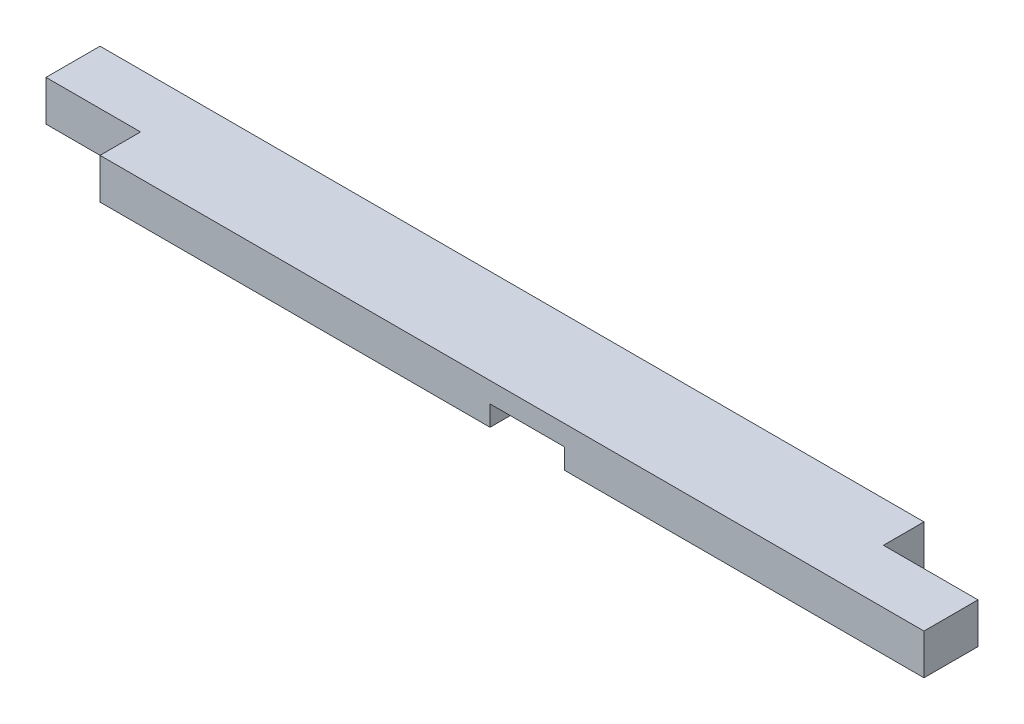
ISO-10303-21;
HEADER;
FILE_DESCRIPTION(('STEP AP214'),'2;1');
FILE_NAME('part.step','',(''),(''),'','','');
FILE_SCHEMA(('AUTOMOTIVE_DESIGN { 1 0 10303 214 1 1 1 1 }'));
ENDSEC;
DATA;
#1=APPLICATION_CONTEXT('core data for automotive mechanical design processes');
#2=APPLICATION_PROTOCOL_DEFINITION('international standard','automotive_design',2000,#1);
#3=PRODUCT_CONTEXT('',#1,'mechanical');
#4=PRODUCT('Part','Part','',(#3));
#5=PRODUCT_RELATED_PRODUCT_CATEGORY('part','',(#4));
#6=PRODUCT_DEFINITION_FORMATION('','',#4);
#7=PRODUCT_DEFINITION_CONTEXT('part definition',#1,'design');
#8=PRODUCT_DEFINITION('design','',#6,#7);
#9=PRODUCT_DEFINITION_SHAPE('','',#8);
#10=(LENGTH_UNIT() NAMED_UNIT(*) SI_UNIT(.MILLI.,.METRE.));
#11=(NAMED_UNIT(*) PLANE_ANGLE_UNIT() SI_UNIT($,.RADIAN.));
#12=(NAMED_UNIT(*) SI_UNIT($,.STERADIAN.) SOLID_ANGLE_UNIT());
#13=UNCERTAINTY_MEASURE_WITH_UNIT(LENGTH_MEASURE(1.E-05),#10,'distance_accuracy_value','');
#14=(GEOMETRIC_REPRESENTATION_CONTEXT(3) GLOBAL_UNCERTAINTY_ASSIGNED_CONTEXT((#13)) GLOBAL_UNIT_ASSIGNED_CONTEXT((#10,
#11,#12)) REPRESENTATION_CONTEXT('',''));
#15=CARTESIAN_POINT('',(0.,0.,0.));
#16=DIRECTION('',(0.,0.,1.));
#17=DIRECTION('',(1.,0.,0.));
#18=AXIS2_PLACEMENT_3D('',#15,#16,#17);
#19=CARTESIAN_POINT('',(0.,0.,0.));
#20=DIRECTION('',(0.,-1.,0.));
#21=DIRECTION('',(0.,0.,-1.));
#22=AXIS2_PLACEMENT_3D('',#19,#20,#21);
#23=PLANE('',#22);
#24=DIRECTION('',(0.,0.,-1.));
#25=VECTOR('',#24,1.);
#26=CARTESIAN_POINT('',(525.4625,0.,0.));
#27=LINE('',#26,#25);
#28=CARTESIAN_POINT('',(525.4625,0.,0.));
#29=VERTEX_POINT('',#28);
#30=CARTESIAN_POINT('',(525.4625,0.,-88.9));
#31=VERTEX_POINT('',#30);
#32=EDGE_CURVE('E197',#29,#31,#27,.T.);
#33=ORIENTED_EDGE('',*,*,#32,.T.);
#34=DIRECTION('',(-1.,0.,0.));
#35=VECTOR('',#34,1.);
#36=CARTESIAN_POINT('',(0.,0.,-88.9));
#37=LINE('',#36,#35);
#38=CARTESIAN_POINT('',(774.7,0.,-88.9));
#39=VERTEX_POINT('',#38);
#40=EDGE_CURVE('E153',#39,#31,#37,.T.);
#41=ORIENTED_EDGE('',*,*,#40,.F.);
#42=DIRECTION('',(0.,0.,1.));
#43=VECTOR('',#42,1.);
#44=CARTESIAN_POINT('',(774.7,0.,-88.9));
#45=LINE('',#44,#43);
#46=CARTESIAN_POINT('',(774.7,0.,-50.8));
#47=VERTEX_POINT('',#46);
#48=EDGE_CURVE('E213',#39,#47,#45,.T.);
#49=ORIENTED_EDGE('',*,*,#48,.T.);
#50=DIRECTION('',(1.,0.,0.));
#51=VECTOR('',#50,1.);
#52=CARTESIAN_POINT('',(863.6,0.,-50.8));
#53=LINE('',#52,#51);
#54=CARTESIAN_POINT('',(863.6,0.,-50.8));
#55=VERTEX_POINT('',#54);
#56=EDGE_CURVE('E216',#47,#55,#53,.T.);
#57=ORIENTED_EDGE('',*,*,#56,.T.);
#58=DIRECTION('',(0.,0.,-1.));
#59=VECTOR('',#58,1.);
#60=CARTESIAN_POINT('',(863.6,0.,0.));
#61=LINE('',#60,#59);
#62=CARTESIAN_POINT('',(863.6,0.,0.));
#63=VERTEX_POINT('',#62);
#64=EDGE_CURVE('E171',#63,#55,#61,.T.);
#65=ORIENTED_EDGE('',*,*,#64,.F.);
#66=DIRECTION('',(1.,0.,0.));
#67=VECTOR('',#66,1.);
#68=CARTESIAN_POINT('',(0.,0.,0.));
#69=LINE('',#68,#67);
#70=EDGE_CURVE('E168',#29,#63,#69,.T.);
#71=ORIENTED_EDGE('',*,*,#70,.F.);
#72=EDGE_LOOP('',(#33,#41,#49,#57,#65,#71));
#73=FACE_BOUND('',#72,.T.);
#74=ADVANCED_FACE('F39',(#73),#23,.T.);
#75=CARTESIAN_POINT('',(0.,38.1,0.));
#76=DIRECTION('',(1.,0.,0.));
#77=DIRECTION('',(0.,0.,-1.));
#78=AXIS2_PLACEMENT_3D('',#75,#76,#77);
#79=PLANE('',#78);
#80=DIRECTION('',(0.,0.,1.));
#81=VECTOR('',#80,1.);
#82=CARTESIAN_POINT('',(0.,0.,0.));
#83=LINE('',#82,#81);
#84=CARTESIAN_POINT('',(0.,0.,-88.9));
#85=VERTEX_POINT('',#84);
#86=CARTESIAN_POINT('',(0.,0.,-38.1));
#87=VERTEX_POINT('',#86);
#88=EDGE_CURVE('E145',#85,#87,#83,.T.);
#89=ORIENTED_EDGE('',*,*,#88,.T.);
#90=DIRECTION('',(0.,-1.,0.));
#91=VECTOR('',#90,1.);
#92=CARTESIAN_POINT('',(0.,38.1,-38.1));
#93=LINE('',#92,#91);
#94=CARTESIAN_POINT('',(0.,38.1,-38.1));
#95=VERTEX_POINT('',#94);
#96=EDGE_CURVE('E54',#95,#87,#93,.T.);
#97=ORIENTED_EDGE('',*,*,#96,.F.);
#98=DIRECTION('',(0.,0.,1.));
#99=VECTOR('',#98,1.);
#100=CARTESIAN_POINT('',(0.,38.1,0.));
#101=LINE('',#100,#99);
#102=CARTESIAN_POINT('',(0.,38.1,-88.9));
#103=VERTEX_POINT('',#102);
#104=EDGE_CURVE('E143',#103,#95,#101,.T.);
#105=ORIENTED_EDGE('',*,*,#104,.F.);
#106=DIRECTION('',(0.,-1.,0.));
#107=VECTOR('',#106,1.);
#108=CARTESIAN_POINT('',(0.,38.1,-88.9));
#109=LINE('',#108,#107);
#110=EDGE_CURVE('E47',#103,#85,#109,.T.);
#111=ORIENTED_EDGE('',*,*,#110,.T.);
#112=EDGE_LOOP('',(#89,#97,#105,#111));
#113=FACE_BOUND('',#112,.T.);
#114=ADVANCED_FACE('F41',(#113),#79,.F.);
#115=CARTESIAN_POINT('',(0.,38.1,0.));
#116=DIRECTION('',(0.,0.,-1.));
#117=DIRECTION('',(-1.,0.,0.));
#118=AXIS2_PLACEMENT_3D('',#115,#116,#117);
#119=PLANE('',#118);
#120=DIRECTION('',(1.,0.,0.));
#121=VECTOR('',#120,1.);
#122=CARTESIAN_POINT('',(0.,38.1,0.));
#123=LINE('',#122,#121);
#124=CARTESIAN_POINT('',(88.9,38.1,0.));
#125=VERTEX_POINT('',#124);
#126=CARTESIAN_POINT('',(863.6,38.1,0.));
#127=VERTEX_POINT('',#126);
#128=EDGE_CURVE('E152',#125,#127,#123,.T.);
#129=ORIENTED_EDGE('',*,*,#128,.F.);
#130=DIRECTION('',(0.,-1.,0.));
#131=VECTOR('',#130,1.);
#132=CARTESIAN_POINT('',(88.9,38.1,0.));
#133=LINE('',#132,#131);
#134=CARTESIAN_POINT('',(88.9,0.,0.));
#135=VERTEX_POINT('',#134);
#136=EDGE_CURVE('E184',#125,#135,#133,.T.);
#137=ORIENTED_EDGE('',*,*,#136,.T.);
#138=CARTESIAN_POINT('',(455.6125,0.,0.));
#139=VERTEX_POINT('',#138);
#140=EDGE_CURVE('E62',#135,#139,#69,.T.);
#141=ORIENTED_EDGE('',*,*,#140,.T.);
#142=DIRECTION('',(0.,1.,0.));
#143=VECTOR('',#142,1.);
#144=CARTESIAN_POINT('',(455.6125,19.0499999999991,0.));
#145=LINE('',#144,#143);
#146=CARTESIAN_POINT('',(455.6125,19.0499999999991,0.));
#147=VERTEX_POINT('',#146);
#148=EDGE_CURVE('E191',#139,#147,#145,.T.);
#149=ORIENTED_EDGE('',*,*,#148,.T.);
#150=DIRECTION('',(1.,0.,0.));
#151=VECTOR('',#150,1.);
#152=CARTESIAN_POINT('',(525.4625,19.0499999999991,0.));
#153=LINE('',#152,#151);
#154=CARTESIAN_POINT('',(525.4625,19.0499999999991,0.));
#155=VERTEX_POINT('',#154);
#156=EDGE_CURVE('E194',#147,#155,#153,.T.);
#157=ORIENTED_EDGE('',*,*,#156,.T.);
#158=DIRECTION('',(0.,-1.,0.));
#159=VECTOR('',#158,1.);
#160=CARTESIAN_POINT('',(525.4625,19.0499999999991,0.));
#161=LINE('',#160,#159);
#162=EDGE_CURVE('E188',#155,#29,#161,.T.);
#163=ORIENTED_EDGE('',*,*,#162,.T.);
#164=ORIENTED_EDGE('',*,*,#70,.T.);
#165=DIRECTION('',(0.,-1.,0.));
#166=VECTOR('',#165,1.);
#167=CARTESIAN_POINT('',(863.6,38.1,0.));
#168=LINE('',#167,#166);
#169=EDGE_CURVE('E11',#127,#63,#168,.T.);
#170=ORIENTED_EDGE('',*,*,#169,.F.);
#171=EDGE_LOOP('',(#129,#137,#141,#149,#157,#163,#164,#170));
#172=FACE_BOUND('',#171,.T.);
#173=ADVANCED_FACE('F244',(#172),#119,.F.);
#174=CARTESIAN_POINT('',(863.6,38.1,0.));
#175=DIRECTION('',(-1.,0.,0.));
#176=DIRECTION('',(0.,0.,1.));
#177=AXIS2_PLACEMENT_3D('',#174,#175,#176);
#178=PLANE('',#177);
#179=ORIENTED_EDGE('',*,*,#64,.T.);
#180=DIRECTION('',(0.,1.,0.));
#181=VECTOR('',#180,1.);
#182=CARTESIAN_POINT('',(863.6,0.,-50.8));
#183=LINE('',#182,#181);
#184=CARTESIAN_POINT('',(863.6,38.1,-50.8));
#185=VERTEX_POINT('',#184);
#186=EDGE_CURVE('E169',#55,#185,#183,.T.);
#187=ORIENTED_EDGE('',*,*,#186,.T.);
#188=DIRECTION('',(0.,0.,-1.));
#189=VECTOR('',#188,1.);
#190=CARTESIAN_POINT('',(863.6,38.1,0.));
#191=LINE('',#190,#189);
#192=EDGE_CURVE('E155',#127,#185,#191,.T.);
#193=ORIENTED_EDGE('',*,*,#192,.F.);
#194=ORIENTED_EDGE('',*,*,#169,.T.);
#195=EDGE_LOOP('',(#179,#187,#193,#194));
#196=FACE_BOUND('',#195,.T.);
#197=ADVANCED_FACE('F235',(#196),#178,.F.);
#198=CARTESIAN_POINT('',(0.,38.1,-88.9));
#199=DIRECTION('',(0.,0.,1.));
#200=DIRECTION('',(1.,0.,0.));
#201=AXIS2_PLACEMENT_3D('',#198,#199,#200);
#202=PLANE('',#201);
#203=ORIENTED_EDGE('',*,*,#40,.T.);
#204=DIRECTION('',(0.,-1.,0.));
#205=VECTOR('',#204,1.);
#206=CARTESIAN_POINT('',(525.4625,19.0499999999991,-88.9));
#207=LINE('',#206,#205);
#208=CARTESIAN_POINT('',(525.4625,19.0499999999991,-88.9));
#209=VERTEX_POINT('',#208);
#210=EDGE_CURVE('E186',#209,#31,#207,.T.);
#211=ORIENTED_EDGE('',*,*,#210,.F.);
#212=DIRECTION('',(1.,0.,0.));
#213=VECTOR('',#212,1.);
#214=CARTESIAN_POINT('',(525.4625,19.0499999999991,-88.9));
#215=LINE('',#214,#213);
#216=CARTESIAN_POINT('',(455.6125,19.0499999999991,-88.9));
#217=VERTEX_POINT('',#216);
#218=EDGE_CURVE('E192',#217,#209,#215,.T.);
#219=ORIENTED_EDGE('',*,*,#218,.F.);
#220=DIRECTION('',(0.,1.,0.));
#221=VECTOR('',#220,1.);
#222=CARTESIAN_POINT('',(455.6125,19.0499999999991,-88.9));
#223=LINE('',#222,#221);
#224=CARTESIAN_POINT('',(455.6125,0.,-88.9));
#225=VERTEX_POINT('',#224);
#226=EDGE_CURVE('E199',#225,#217,#223,.T.);
#227=ORIENTED_EDGE('',*,*,#226,.F.);
#228=EDGE_CURVE('E158',#225,#85,#37,.T.);
#229=ORIENTED_EDGE('',*,*,#228,.T.);
#230=ORIENTED_EDGE('',*,*,#110,.F.);
#231=DIRECTION('',(-1.,0.,0.));
#232=VECTOR('',#231,1.);
#233=CARTESIAN_POINT('',(0.,38.1,-88.9));
#234=LINE('',#233,#232);
#235=CARTESIAN_POINT('',(774.7,38.1,-88.9));
#236=VERTEX_POINT('',#235);
#237=EDGE_CURVE('E150',#236,#103,#234,.T.);
#238=ORIENTED_EDGE('',*,*,#237,.F.);
#239=DIRECTION('',(0.,1.,0.));
#240=VECTOR('',#239,1.);
#241=CARTESIAN_POINT('',(774.7,0.,-88.9));
#242=LINE('',#241,#240);
#243=EDGE_CURVE('E161',#39,#236,#242,.T.);
#244=ORIENTED_EDGE('',*,*,#243,.F.);
#245=EDGE_LOOP('',(#203,#211,#219,#227,#229,#230,#238,#244));
#246=FACE_BOUND('',#245,.T.);
#247=ADVANCED_FACE('F232',(#246),#202,.F.);
#248=CARTESIAN_POINT('',(0.,38.1,0.));
#249=DIRECTION('',(0.,-1.,0.));
#250=DIRECTION('',(0.,0.,-1.));
#251=AXIS2_PLACEMENT_3D('',#248,#249,#250);
#252=PLANE('',#251);
#253=DIRECTION('',(1.,0.,0.));
#254=VECTOR('',#253,1.);
#255=CARTESIAN_POINT('',(0.,38.1,-38.1));
#256=LINE('',#255,#254);
#257=CARTESIAN_POINT('',(88.9,38.1,-38.1));
#258=VERTEX_POINT('',#257);
#259=EDGE_CURVE('E129',#95,#258,#256,.T.);
#260=ORIENTED_EDGE('',*,*,#259,.T.);
#261=DIRECTION('',(0.,0.,1.));
#262=VECTOR('',#261,1.);
#263=CARTESIAN_POINT('',(88.9,38.1,0.));
#264=LINE('',#263,#262);
#265=EDGE_CURVE('E136',#258,#125,#264,.T.);
#266=ORIENTED_EDGE('',*,*,#265,.T.);
#267=ORIENTED_EDGE('',*,*,#128,.T.);
#268=ORIENTED_EDGE('',*,*,#192,.T.);
#269=DIRECTION('',(1.,0.,0.));
#270=VECTOR('',#269,1.);
#271=CARTESIAN_POINT('',(863.6,38.1,-50.8));
#272=LINE('',#271,#270);
#273=CARTESIAN_POINT('',(774.7,38.1,-50.8));
#274=VERTEX_POINT('',#273);
#275=EDGE_CURVE('E217',#274,#185,#272,.T.);
#276=ORIENTED_EDGE('',*,*,#275,.F.);
#277=DIRECTION('',(0.,0.,1.));
#278=VECTOR('',#277,1.);
#279=CARTESIAN_POINT('',(774.7,38.1,-88.9));
#280=LINE('',#279,#278);
#281=EDGE_CURVE('E206',#236,#274,#280,.T.);
#282=ORIENTED_EDGE('',*,*,#281,.F.);
#283=ORIENTED_EDGE('',*,*,#237,.T.);
#284=ORIENTED_EDGE('',*,*,#104,.T.);
#285=EDGE_LOOP('',(#260,#266,#267,#268,#276,#282,#283,#284));
#286=FACE_BOUND('',#285,.T.);
#287=ADVANCED_FACE('F147',(#286),#252,.F.);
#288=DIRECTION('',(0.,0.,1.));
#289=VECTOR('',#288,1.);
#290=CARTESIAN_POINT('',(88.9,0.,0.));
#291=LINE('',#290,#289);
#292=CARTESIAN_POINT('',(88.9,0.,-38.1));
#293=VERTEX_POINT('',#292);
#294=EDGE_CURVE('E137',#293,#135,#291,.T.);
#295=ORIENTED_EDGE('',*,*,#294,.F.);
#296=DIRECTION('',(1.,0.,0.));
#297=VECTOR('',#296,1.);
#298=CARTESIAN_POINT('',(0.,0.,-38.1));
#299=LINE('',#298,#297);
#300=EDGE_CURVE('E179',#87,#293,#299,.T.);
#301=ORIENTED_EDGE('',*,*,#300,.F.);
#302=ORIENTED_EDGE('',*,*,#88,.F.);
#303=ORIENTED_EDGE('',*,*,#228,.F.);
#304=DIRECTION('',(0.,0.,-1.));
#305=VECTOR('',#304,1.);
#306=CARTESIAN_POINT('',(455.6125,0.,0.));
#307=LINE('',#306,#305);
#308=EDGE_CURVE('E209',#139,#225,#307,.T.);
#309=ORIENTED_EDGE('',*,*,#308,.F.);
#310=ORIENTED_EDGE('',*,*,#140,.F.);
#311=EDGE_LOOP('',(#295,#301,#302,#303,#309,#310));
#312=FACE_BOUND('',#311,.T.);
#313=ADVANCED_FACE('F177',(#312),#23,.T.);
#314=CARTESIAN_POINT('',(863.6,0.,-50.8));
#315=DIRECTION('',(0.,0.,1.));
#316=DIRECTION('',(1.,0.,0.));
#317=AXIS2_PLACEMENT_3D('',#314,#315,#316);
#318=PLANE('',#317);
#319=ORIENTED_EDGE('',*,*,#275,.T.);
#320=ORIENTED_EDGE('',*,*,#186,.F.);
#321=ORIENTED_EDGE('',*,*,#56,.F.);
#322=DIRECTION('',(0.,1.,0.));
#323=VECTOR('',#322,1.);
#324=CARTESIAN_POINT('',(774.7,0.,-50.8));
#325=LINE('',#324,#323);
#326=EDGE_CURVE('E224',#47,#274,#325,.T.);
#327=ORIENTED_EDGE('',*,*,#326,.T.);
#328=EDGE_LOOP('',(#319,#320,#321,#327));
#329=FACE_BOUND('',#328,.T.);
#330=ADVANCED_FACE('F254',(#329),#318,.F.);
#331=CARTESIAN_POINT('',(774.7,0.,-88.9));
#332=DIRECTION('',(-1.,0.,0.));
#333=DIRECTION('',(0.,0.,1.));
#334=AXIS2_PLACEMENT_3D('',#331,#332,#333);
#335=PLANE('',#334);
#336=ORIENTED_EDGE('',*,*,#281,.T.);
#337=ORIENTED_EDGE('',*,*,#326,.F.);
#338=ORIENTED_EDGE('',*,*,#48,.F.);
#339=ORIENTED_EDGE('',*,*,#243,.T.);
#340=EDGE_LOOP('',(#336,#337,#338,#339));
#341=FACE_BOUND('',#340,.T.);
#342=ADVANCED_FACE('F229',(#341),#335,.F.);
#343=CARTESIAN_POINT('',(525.4625,19.0499999999991,0.));
#344=DIRECTION('',(1.,0.,0.));
#345=DIRECTION('',(0.,0.,-1.));
#346=AXIS2_PLACEMENT_3D('',#343,#344,#345);
#347=PLANE('',#346);
#348=ORIENTED_EDGE('',*,*,#210,.T.);
#349=ORIENTED_EDGE('',*,*,#32,.F.);
#350=ORIENTED_EDGE('',*,*,#162,.F.);
#351=DIRECTION('',(0.,0.,-1.));
#352=VECTOR('',#351,1.);
#353=CARTESIAN_POINT('',(525.4625,19.0499999999991,0.));
#354=LINE('',#353,#352);
#355=EDGE_CURVE('E204',#155,#209,#354,.T.);
#356=ORIENTED_EDGE('',*,*,#355,.T.);
#357=EDGE_LOOP('',(#348,#349,#350,#356));
#358=FACE_BOUND('',#357,.T.);
#359=ADVANCED_FACE('F262',(#358),#347,.F.);
#360=CARTESIAN_POINT('',(525.4625,19.0499999999991,0.));
#361=DIRECTION('',(0.,1.,0.));
#362=DIRECTION('',(-1.,0.,0.));
#363=AXIS2_PLACEMENT_3D('',#360,#361,#362);
#364=PLANE('',#363);
#365=ORIENTED_EDGE('',*,*,#218,.T.);
#366=ORIENTED_EDGE('',*,*,#355,.F.);
#367=ORIENTED_EDGE('',*,*,#156,.F.);
#368=DIRECTION('',(0.,0.,-1.));
#369=VECTOR('',#368,1.);
#370=CARTESIAN_POINT('',(455.6125,19.0499999999991,0.));
#371=LINE('',#370,#369);
#372=EDGE_CURVE('E207',#147,#217,#371,.T.);
#373=ORIENTED_EDGE('',*,*,#372,.T.);
#374=EDGE_LOOP('',(#365,#366,#367,#373));
#375=FACE_BOUND('',#374,.T.);
#376=ADVANCED_FACE('F266',(#375),#364,.F.);
#377=CARTESIAN_POINT('',(455.6125,19.0499999999991,0.));
#378=DIRECTION('',(-1.,0.,0.));
#379=DIRECTION('',(0.,0.,1.));
#380=AXIS2_PLACEMENT_3D('',#377,#378,#379);
#381=PLANE('',#380);
#382=ORIENTED_EDGE('',*,*,#226,.T.);
#383=ORIENTED_EDGE('',*,*,#372,.F.);
#384=ORIENTED_EDGE('',*,*,#148,.F.);
#385=ORIENTED_EDGE('',*,*,#308,.T.);
#386=EDGE_LOOP('',(#382,#383,#384,#385));
#387=FACE_BOUND('',#386,.T.);
#388=ADVANCED_FACE('F268',(#387),#381,.F.);
#389=CARTESIAN_POINT('',(88.9,38.1,0.));
#390=DIRECTION('',(1.,0.,0.));
#391=DIRECTION('',(0.,0.,-1.));
#392=AXIS2_PLACEMENT_3D('',#389,#390,#391);
#393=PLANE('',#392);
#394=ORIENTED_EDGE('',*,*,#294,.T.);
#395=ORIENTED_EDGE('',*,*,#136,.F.);
#396=ORIENTED_EDGE('',*,*,#265,.F.);
#397=DIRECTION('',(0.,-1.,0.));
#398=VECTOR('',#397,1.);
#399=CARTESIAN_POINT('',(88.9,38.1,-38.1));
#400=LINE('',#399,#398);
#401=EDGE_CURVE('E131',#258,#293,#400,.T.);
#402=ORIENTED_EDGE('',*,*,#401,.T.);
#403=EDGE_LOOP('',(#394,#395,#396,#402));
#404=FACE_BOUND('',#403,.T.);
#405=ADVANCED_FACE('F271',(#404),#393,.F.);
#406=CARTESIAN_POINT('',(0.,38.1,-38.1));
#407=DIRECTION('',(0.,0.,-1.));
#408=DIRECTION('',(-1.,0.,0.));
#409=AXIS2_PLACEMENT_3D('',#406,#407,#408);
#410=PLANE('',#409);
#411=ORIENTED_EDGE('',*,*,#300,.T.);
#412=ORIENTED_EDGE('',*,*,#401,.F.);
#413=ORIENTED_EDGE('',*,*,#259,.F.);
#414=ORIENTED_EDGE('',*,*,#96,.T.);
#415=EDGE_LOOP('',(#411,#412,#413,#414));
#416=FACE_BOUND('',#415,.T.);
#417=ADVANCED_FACE('F130',(#416),#410,.F.);
#418=CLOSED_SHELL('',(#74,#114,#173,#197,#247,#287,#313,#330,#342,#359,#376,#388,#405,#417));
#419=MANIFOLD_SOLID_BREP('B2',#418);
#420=ADVANCED_BREP_SHAPE_REPRESENTATION('',(#18,#419),#14);
#421=SHAPE_DEFINITION_REPRESENTATION(#9,#420);
ENDSEC;
END-ISO-10303-21;
